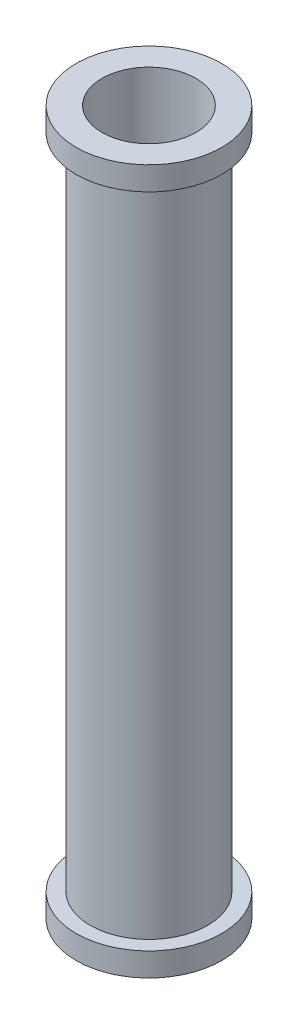
ISO-10303-21;
HEADER;
FILE_DESCRIPTION(('STEP AP214'),'2;1');
FILE_NAME('part.step','',(''),(''),'','','');
FILE_SCHEMA(('AUTOMOTIVE_DESIGN { 1 0 10303 214 1 1 1 1 }'));
ENDSEC;
DATA;
#1=APPLICATION_CONTEXT('core data for automotive mechanical design processes');
#2=APPLICATION_PROTOCOL_DEFINITION('international standard','automotive_design',2000,#1);
#3=PRODUCT_CONTEXT('',#1,'mechanical');
#4=PRODUCT('Part','Part','',(#3));
#5=PRODUCT_RELATED_PRODUCT_CATEGORY('part','',(#4));
#6=PRODUCT_DEFINITION_FORMATION('','',#4);
#7=PRODUCT_DEFINITION_CONTEXT('part definition',#1,'design');
#8=PRODUCT_DEFINITION('design','',#6,#7);
#9=PRODUCT_DEFINITION_SHAPE('','',#8);
#10=(LENGTH_UNIT() NAMED_UNIT(*) SI_UNIT(.MILLI.,.METRE.));
#11=(NAMED_UNIT(*) PLANE_ANGLE_UNIT() SI_UNIT($,.RADIAN.));
#12=(NAMED_UNIT(*) SI_UNIT($,.STERADIAN.) SOLID_ANGLE_UNIT());
#13=UNCERTAINTY_MEASURE_WITH_UNIT(LENGTH_MEASURE(1.E-05),#10,'distance_accuracy_value','');
#14=(GEOMETRIC_REPRESENTATION_CONTEXT(3) GLOBAL_UNCERTAINTY_ASSIGNED_CONTEXT((#13)) GLOBAL_UNIT_ASSIGNED_CONTEXT((#10,
#11,#12)) REPRESENTATION_CONTEXT('',''));
#15=CARTESIAN_POINT('',(0.,0.,0.));
#16=DIRECTION('',(0.,0.,1.));
#17=DIRECTION('',(1.,0.,0.));
#18=AXIS2_PLACEMENT_3D('',#15,#16,#17);
#19=CARTESIAN_POINT('',(0.,1.5,0.));
#20=DIRECTION('',(0.,-1.,0.));
#21=DIRECTION('',(0.,0.,-1.));
#22=AXIS2_PLACEMENT_3D('',#19,#20,#21);
#23=CYLINDRICAL_SURFACE('',#22,0.25);
#24=CARTESIAN_POINT('',(0.,0.1,0.));
#25=DIRECTION('',(0.,1.,0.));
#26=DIRECTION('',(0.,0.,1.));
#27=AXIS2_PLACEMENT_3D('',#24,#25,#26);
#28=CIRCLE('',#27,0.25);
#29=CARTESIAN_POINT('',(0.,0.1,0.25));
#30=VERTEX_POINT('',#29);
#31=EDGE_CURVE('E34',#30,#30,#28,.T.);
#32=ORIENTED_EDGE('',*,*,#31,.T.);
#33=EDGE_LOOP('',(#32));
#34=FACE_BOUND('',#33,.T.);
#35=CARTESIAN_POINT('',(0.,2.9,0.));
#36=DIRECTION('',(0.,1.,0.));
#37=DIRECTION('',(0.,0.,1.));
#38=AXIS2_PLACEMENT_3D('',#35,#36,#37);
#39=CIRCLE('',#38,0.25);
#40=CARTESIAN_POINT('',(0.,2.9,0.25));
#41=VERTEX_POINT('',#40);
#42=EDGE_CURVE('E49',#41,#41,#39,.T.);
#43=ORIENTED_EDGE('',*,*,#42,.F.);
#44=EDGE_LOOP('',(#43));
#45=FACE_BOUND('',#44,.T.);
#46=ADVANCED_FACE('F31',(#34,#45),#23,.T.);
#47=CARTESIAN_POINT('',(0.,0.,0.));
#48=DIRECTION('',(0.,1.,0.));
#49=DIRECTION('',(0.,0.,1.));
#50=AXIS2_PLACEMENT_3D('',#47,#48,#49);
#51=PLANE('',#50);
#52=CARTESIAN_POINT('',(0.,0.,0.));
#53=DIRECTION('',(0.,1.,0.));
#54=DIRECTION('',(0.,0.,1.));
#55=AXIS2_PLACEMENT_3D('',#52,#53,#54);
#56=CIRCLE('',#55,0.2);
#57=CARTESIAN_POINT('',(0.,0.,0.2));
#58=VERTEX_POINT('',#57);
#59=EDGE_CURVE('E10',#58,#58,#56,.T.);
#60=ORIENTED_EDGE('',*,*,#59,.T.);
#61=EDGE_LOOP('',(#60));
#62=FACE_BOUND('',#61,.T.);
#63=CARTESIAN_POINT('',(0.,0.,0.));
#64=DIRECTION('',(0.,1.,0.));
#65=DIRECTION('',(0.,0.,1.));
#66=AXIS2_PLACEMENT_3D('',#63,#64,#65);
#67=CIRCLE('',#66,0.31);
#68=CARTESIAN_POINT('',(0.,0.,0.31));
#69=VERTEX_POINT('',#68);
#70=EDGE_CURVE('E43',#69,#69,#67,.T.);
#71=ORIENTED_EDGE('',*,*,#70,.F.);
#72=EDGE_LOOP('',(#71));
#73=FACE_BOUND('',#72,.T.);
#74=ADVANCED_FACE('F74',(#62,#73),#51,.F.);
#75=CARTESIAN_POINT('',(0.,1.5,0.));
#76=DIRECTION('',(0.,-1.,0.));
#77=DIRECTION('',(0.,0.,-1.));
#78=AXIS2_PLACEMENT_3D('',#75,#76,#77);
#79=CYLINDRICAL_SURFACE('',#78,0.2);
#80=ORIENTED_EDGE('',*,*,#59,.F.);
#81=EDGE_LOOP('',(#80));
#82=FACE_BOUND('',#81,.T.);
#83=CARTESIAN_POINT('',(0.,3.,0.));
#84=DIRECTION('',(0.,1.,0.));
#85=DIRECTION('',(0.,0.,1.));
#86=AXIS2_PLACEMENT_3D('',#83,#84,#85);
#87=CIRCLE('',#86,0.2);
#88=CARTESIAN_POINT('',(0.,3.,0.2));
#89=VERTEX_POINT('',#88);
#90=EDGE_CURVE('E46',#89,#89,#87,.T.);
#91=ORIENTED_EDGE('',*,*,#90,.T.);
#92=EDGE_LOOP('',(#91));
#93=FACE_BOUND('',#92,.T.);
#94=ADVANCED_FACE('F79',(#82,#93),#79,.F.);
#95=CARTESIAN_POINT('',(0.,0.1,0.));
#96=DIRECTION('',(0.,-1.,0.));
#97=DIRECTION('',(0.,0.,-1.));
#98=AXIS2_PLACEMENT_3D('',#95,#96,#97);
#99=CYLINDRICAL_SURFACE('',#98,0.31);
#100=CARTESIAN_POINT('',(0.,0.1,0.));
#101=DIRECTION('',(0.,1.,0.));
#102=DIRECTION('',(0.,0.,1.));
#103=AXIS2_PLACEMENT_3D('',#100,#101,#102);
#104=CIRCLE('',#103,0.31);
#105=CARTESIAN_POINT('',(0.,0.1,0.31));
#106=VERTEX_POINT('',#105);
#107=EDGE_CURVE('E41',#106,#106,#104,.T.);
#108=ORIENTED_EDGE('',*,*,#107,.F.);
#109=EDGE_LOOP('',(#108));
#110=FACE_BOUND('',#109,.T.);
#111=ORIENTED_EDGE('',*,*,#70,.T.);
#112=EDGE_LOOP('',(#111));
#113=FACE_BOUND('',#112,.T.);
#114=ADVANCED_FACE('F87',(#110,#113),#99,.T.);
#115=CARTESIAN_POINT('',(0.,0.1,0.));
#116=DIRECTION('',(0.,1.,0.));
#117=DIRECTION('',(0.,0.,1.));
#118=AXIS2_PLACEMENT_3D('',#115,#116,#117);
#119=PLANE('',#118);
#120=ORIENTED_EDGE('',*,*,#31,.F.);
#121=EDGE_LOOP('',(#120));
#122=FACE_BOUND('',#121,.T.);
#123=ORIENTED_EDGE('',*,*,#107,.T.);
#124=EDGE_LOOP('',(#123));
#125=FACE_BOUND('',#124,.T.);
#126=ADVANCED_FACE('F84',(#122,#125),#119,.T.);
#127=CARTESIAN_POINT('',(0.,3.,0.));
#128=DIRECTION('',(0.,-1.,0.));
#129=DIRECTION('',(0.,0.,1.));
#130=AXIS2_PLACEMENT_3D('',#127,#128,#129);
#131=PLANE('',#130);
#132=ORIENTED_EDGE('',*,*,#90,.F.);
#133=EDGE_LOOP('',(#132));
#134=FACE_BOUND('',#133,.T.);
#135=CARTESIAN_POINT('',(0.,3.,0.));
#136=DIRECTION('',(0.,1.,0.));
#137=DIRECTION('',(0.,0.,1.));
#138=AXIS2_PLACEMENT_3D('',#135,#136,#137);
#139=CIRCLE('',#138,0.31);
#140=CARTESIAN_POINT('',(0.,3.,0.31));
#141=VERTEX_POINT('',#140);
#142=EDGE_CURVE('E55',#141,#141,#139,.T.);
#143=ORIENTED_EDGE('',*,*,#142,.T.);
#144=EDGE_LOOP('',(#143));
#145=FACE_BOUND('',#144,.T.);
#146=ADVANCED_FACE('F71',(#134,#145),#131,.F.);
#147=CARTESIAN_POINT('',(0.,2.9,0.));
#148=DIRECTION('',(0.,1.,0.));
#149=DIRECTION('',(0.,0.,-1.));
#150=AXIS2_PLACEMENT_3D('',#147,#148,#149);
#151=CYLINDRICAL_SURFACE('',#150,0.31);
#152=CARTESIAN_POINT('',(0.,2.9,0.));
#153=DIRECTION('',(0.,1.,0.));
#154=DIRECTION('',(0.,0.,1.));
#155=AXIS2_PLACEMENT_3D('',#152,#153,#154);
#156=CIRCLE('',#155,0.31);
#157=CARTESIAN_POINT('',(0.,2.9,0.31));
#158=VERTEX_POINT('',#157);
#159=EDGE_CURVE('E52',#158,#158,#156,.T.);
#160=ORIENTED_EDGE('',*,*,#159,.T.);
#161=EDGE_LOOP('',(#160));
#162=FACE_BOUND('',#161,.T.);
#163=ORIENTED_EDGE('',*,*,#142,.F.);
#164=EDGE_LOOP('',(#163));
#165=FACE_BOUND('',#164,.T.);
#166=ADVANCED_FACE('F61',(#162,#165),#151,.T.);
#167=CARTESIAN_POINT('',(0.,2.9,0.));
#168=DIRECTION('',(0.,-1.,0.));
#169=DIRECTION('',(0.,0.,1.));
#170=AXIS2_PLACEMENT_3D('',#167,#168,#169);
#171=PLANE('',#170);
#172=ORIENTED_EDGE('',*,*,#42,.T.);
#173=EDGE_LOOP('',(#172));
#174=FACE_BOUND('',#173,.T.);
#175=ORIENTED_EDGE('',*,*,#159,.F.);
#176=EDGE_LOOP('',(#175));
#177=FACE_BOUND('',#176,.T.);
#178=ADVANCED_FACE('F64',(#174,#177),#171,.T.);
#179=CLOSED_SHELL('',(#46,#74,#94,#114,#126,#146,#166,#178));
#180=MANIFOLD_SOLID_BREP('B2',#179);
#181=ADVANCED_BREP_SHAPE_REPRESENTATION('',(#18,#180),#14);
#182=SHAPE_DEFINITION_REPRESENTATION(#9,#181);
ENDSEC;
END-ISO-10303-21;
